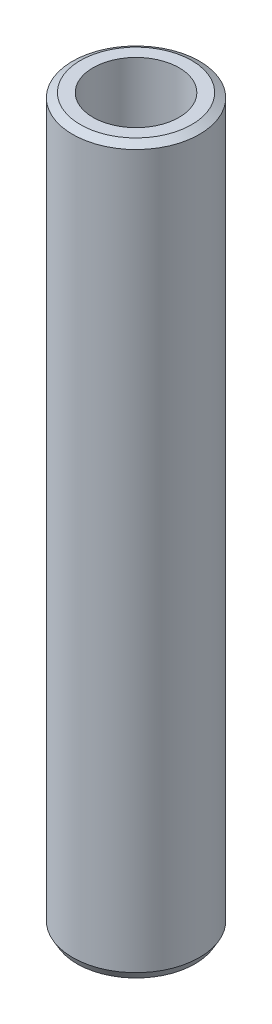
ISO-10303-21;
HEADER;
FILE_DESCRIPTION(('STEP AP214'),'2;1');
FILE_NAME('part.step','',(''),(''),'','','');
FILE_SCHEMA(('AUTOMOTIVE_DESIGN { 1 0 10303 214 1 1 1 1 }'));
ENDSEC;
DATA;
#1=APPLICATION_CONTEXT('core data for automotive mechanical design processes');
#2=APPLICATION_PROTOCOL_DEFINITION('international standard','automotive_design',2000,#1);
#3=PRODUCT_CONTEXT('',#1,'mechanical');
#4=PRODUCT('Part','Part','',(#3));
#5=PRODUCT_RELATED_PRODUCT_CATEGORY('part','',(#4));
#6=PRODUCT_DEFINITION_FORMATION('','',#4);
#7=PRODUCT_DEFINITION_CONTEXT('part definition',#1,'design');
#8=PRODUCT_DEFINITION('design','',#6,#7);
#9=PRODUCT_DEFINITION_SHAPE('','',#8);
#10=(LENGTH_UNIT() NAMED_UNIT(*) SI_UNIT(.MILLI.,.METRE.));
#11=(NAMED_UNIT(*) PLANE_ANGLE_UNIT() SI_UNIT($,.RADIAN.));
#12=(NAMED_UNIT(*) SI_UNIT($,.STERADIAN.) SOLID_ANGLE_UNIT());
#13=UNCERTAINTY_MEASURE_WITH_UNIT(LENGTH_MEASURE(1.E-05),#10,'distance_accuracy_value','');
#14=(GEOMETRIC_REPRESENTATION_CONTEXT(3) GLOBAL_UNCERTAINTY_ASSIGNED_CONTEXT((#13)) GLOBAL_UNIT_ASSIGNED_CONTEXT((#10,
#11,#12)) REPRESENTATION_CONTEXT('',''));
#15=CARTESIAN_POINT('',(0.,0.,0.));
#16=DIRECTION('',(0.,0.,1.));
#17=DIRECTION('',(1.,0.,0.));
#18=AXIS2_PLACEMENT_3D('',#15,#16,#17);
#19=CARTESIAN_POINT('',(0.,600.,0.));
#20=DIRECTION('',(0.,-1.,0.));
#21=DIRECTION('',(0.,0.,-1.));
#22=AXIS2_PLACEMENT_3D('',#19,#20,#21);
#23=CYLINDRICAL_SURFACE('',#22,52.5);
#24=CARTESIAN_POINT('',(0.,596.267829489792,0.));
#25=DIRECTION('',(0.,1.,0.));
#26=DIRECTION('',(0.,0.,1.));
#27=AXIS2_PLACEMENT_3D('',#24,#25,#26);
#28=CIRCLE('',#27,52.5);
#29=CARTESIAN_POINT('',(0.,596.267829489792,-52.5000000000001));
#30=VERTEX_POINT('',#29);
#31=EDGE_CURVE('E50',#30,#30,#28,.F.);
#32=ORIENTED_EDGE('',*,*,#31,.T.);
#33=EDGE_LOOP('',(#32));
#34=FACE_BOUND('',#33,.T.);
#35=CARTESIAN_POINT('',(0.,6.46430894618999,0.));
#36=DIRECTION('',(0.,1.,0.));
#37=DIRECTION('',(0.,0.,1.));
#38=AXIS2_PLACEMENT_3D('',#35,#36,#37);
#39=CIRCLE('',#38,52.5);
#40=CARTESIAN_POINT('',(0.,6.46430894618999,52.5));
#41=VERTEX_POINT('',#40);
#42=EDGE_CURVE('E51',#41,#41,#39,.T.);
#43=ORIENTED_EDGE('',*,*,#42,.T.);
#44=EDGE_LOOP('',(#43));
#45=FACE_BOUND('',#44,.T.);
#46=ADVANCED_FACE('F39',(#34,#45),#23,.T.);
#47=CARTESIAN_POINT('',(0.,600.,0.));
#48=DIRECTION('',(0.,1.,0.));
#49=DIRECTION('',(0.,0.,1.));
#50=AXIS2_PLACEMENT_3D('',#47,#48,#49);
#51=PLANE('',#50);
#52=CARTESIAN_POINT('',(0.,600.,0.));
#53=DIRECTION('',(0.,1.,0.));
#54=DIRECTION('',(0.,0.,1.));
#55=AXIS2_PLACEMENT_3D('',#52,#53,#54);
#56=CIRCLE('',#55,46.03569105381);
#57=CARTESIAN_POINT('',(0.,600.,-46.0356910538101));
#58=VERTEX_POINT('',#57);
#59=EDGE_CURVE('E54',#58,#58,#56,.T.);
#60=ORIENTED_EDGE('',*,*,#59,.T.);
#61=EDGE_LOOP('',(#60));
#62=FACE_BOUND('',#61,.T.);
#63=CARTESIAN_POINT('',(0.,600.,0.));
#64=DIRECTION('',(0.,1.,0.));
#65=DIRECTION('',(0.,0.,1.));
#66=AXIS2_PLACEMENT_3D('',#63,#64,#65);
#67=CIRCLE('',#66,35.6017943521871);
#68=CARTESIAN_POINT('',(0.,600.,35.6017943521871));
#69=VERTEX_POINT('',#68);
#70=EDGE_CURVE('E58',#69,#69,#67,.T.);
#71=ORIENTED_EDGE('',*,*,#70,.F.);
#72=EDGE_LOOP('',(#71));
#73=FACE_BOUND('',#72,.T.);
#74=ADVANCED_FACE('F69',(#62,#73),#51,.T.);
#75=CARTESIAN_POINT('',(0.,0.,0.));
#76=DIRECTION('',(0.,1.,0.));
#77=DIRECTION('',(0.,0.,1.));
#78=AXIS2_PLACEMENT_3D('',#75,#76,#77);
#79=PLANE('',#78);
#80=CARTESIAN_POINT('',(0.,0.,0.));
#81=DIRECTION('',(0.,1.,0.));
#82=DIRECTION('',(0.,0.,1.));
#83=AXIS2_PLACEMENT_3D('',#80,#81,#82);
#84=CIRCLE('',#83,48.7678294897922);
#85=CARTESIAN_POINT('',(0.,0.,48.7678294897922));
#86=VERTEX_POINT('',#85);
#87=EDGE_CURVE('E10',#86,#86,#84,.F.);
#88=ORIENTED_EDGE('',*,*,#87,.T.);
#89=EDGE_LOOP('',(#88));
#90=FACE_BOUND('',#89,.T.);
#91=CARTESIAN_POINT('',(0.,0.,0.));
#92=DIRECTION('',(0.,1.,0.));
#93=DIRECTION('',(0.,0.,1.));
#94=AXIS2_PLACEMENT_3D('',#91,#92,#93);
#95=CIRCLE('',#94,35.6017943521871);
#96=CARTESIAN_POINT('',(0.,0.,35.6017943521871));
#97=VERTEX_POINT('',#96);
#98=EDGE_CURVE('E63',#97,#97,#95,.T.);
#99=ORIENTED_EDGE('',*,*,#98,.T.);
#100=EDGE_LOOP('',(#99));
#101=FACE_BOUND('',#100,.T.);
#102=ADVANCED_FACE('F75',(#90,#101),#79,.F.);
#103=CARTESIAN_POINT('',(0.,600.,0.));
#104=DIRECTION('',(0.,-1.,0.));
#105=DIRECTION('',(0.,0.,-1.));
#106=AXIS2_PLACEMENT_3D('',#103,#104,#105);
#107=CYLINDRICAL_SURFACE('',#106,35.6017943521871);
#108=ORIENTED_EDGE('',*,*,#70,.T.);
#109=EDGE_LOOP('',(#108));
#110=FACE_BOUND('',#109,.T.);
#111=ORIENTED_EDGE('',*,*,#98,.F.);
#112=EDGE_LOOP('',(#111));
#113=FACE_BOUND('',#112,.T.);
#114=ADVANCED_FACE('F70',(#110,#113),#107,.F.);
#115=CARTESIAN_POINT('',(0.,600.,0.));
#116=DIRECTION('',(0.,-1.,0.));
#117=DIRECTION('',(0.,0.,-1.));
#118=AXIS2_PLACEMENT_3D('',#115,#116,#117);
#119=CONICAL_SURFACE('',#118,46.03569105381,1.04719755119659);
#120=CARTESIAN_POINT('',(0.,596.267829489792,-52.5000000000001));
#121=CARTESIAN_POINT('',(0.,596.30670626594,-52.4326634484773));
#122=CARTESIAN_POINT('',(0.,596.345583042088,-52.3653268969545));
#123=CARTESIAN_POINT('',(0.,596.423336594384,-52.2306537939088));
#124=CARTESIAN_POINT('',(0.,596.462213370532,-52.163317242386));
#125=CARTESIAN_POINT('',(0.,596.539966922828,-52.0286441393404));
#126=CARTESIAN_POINT('',(0.,596.578843698976,-51.9613075878176));
#127=CARTESIAN_POINT('',(0.,596.656597251272,-51.826634484772));
#128=CARTESIAN_POINT('',(0.,596.69547402742,-51.7592979332492));
#129=CARTESIAN_POINT('',(0.,596.773227579716,-51.6246248302035));
#130=CARTESIAN_POINT('',(0.,596.812104355864,-51.5572882786807));
#131=CARTESIAN_POINT('',(0.,596.88985790816,-51.4226151756351));
#132=CARTESIAN_POINT('',(0.,596.928734684308,-51.3552786241123));
#133=CARTESIAN_POINT('',(0.,597.006488236604,-51.2206055210667));
#134=CARTESIAN_POINT('',(0.,597.045365012752,-51.1532689695439));
#135=CARTESIAN_POINT('',(0.,597.123118565048,-51.0185958664982));
#136=CARTESIAN_POINT('',(0.,597.161995341196,-50.9512593149754));
#137=CARTESIAN_POINT('',(0.,597.239748893492,-50.8165862119298));
#138=CARTESIAN_POINT('',(0.,597.27862566964,-50.749249660407));
#139=CARTESIAN_POINT('',(0.,597.356379221936,-50.6145765573613));
#140=CARTESIAN_POINT('',(0.,597.395255998084,-50.5472400058385));
#141=CARTESIAN_POINT('',(0.,597.47300955038,-50.4125669027929));
#142=CARTESIAN_POINT('',(0.,597.511886326528,-50.3452303512701));
#143=CARTESIAN_POINT('',(0.,597.589639878824,-50.2105572482245));
#144=CARTESIAN_POINT('',(0.,597.628516654972,-50.1432206967017));
#145=CARTESIAN_POINT('',(0.,597.706270207268,-50.008547593656));
#146=CARTESIAN_POINT('',(0.,597.745146983416,-49.9412110421332));
#147=CARTESIAN_POINT('',(0.,597.822900535712,-49.8065379390876));
#148=CARTESIAN_POINT('',(0.,597.86177731186,-49.7392013875648));
#149=CARTESIAN_POINT('',(0.,597.939530864156,-49.6045282845192));
#150=CARTESIAN_POINT('',(0.,597.978407640304,-49.5371917329963));
#151=CARTESIAN_POINT('',(0.,598.0561611926,-49.4025186299507));
#152=CARTESIAN_POINT('',(0.,598.095037968748,-49.3351820784279));
#153=CARTESIAN_POINT('',(0.,598.172791521044,-49.2005089753823));
#154=CARTESIAN_POINT('',(0.,598.211668297192,-49.1331724238595));
#155=CARTESIAN_POINT('',(0.,598.289421849488,-48.9984993208138));
#156=CARTESIAN_POINT('',(0.,598.328298625636,-48.931162769291));
#157=CARTESIAN_POINT('',(0.,598.406052177932,-48.7964896662454));
#158=CARTESIAN_POINT('',(0.,598.44492895408,-48.7291531147226));
#159=CARTESIAN_POINT('',(0.,598.522682506376,-48.594480011677));
#160=CARTESIAN_POINT('',(0.,598.561559282524,-48.5271434601542));
#161=CARTESIAN_POINT('',(0.,598.63931283482,-48.3924703571085));
#162=CARTESIAN_POINT('',(0.,598.678189610968,-48.3251338055857));
#163=CARTESIAN_POINT('',(0.,598.755943163264,-48.1904607025401));
#164=CARTESIAN_POINT('',(0.,598.794819939412,-48.1231241510173));
#165=CARTESIAN_POINT('',(0.,598.872573491708,-47.9884510479717));
#166=CARTESIAN_POINT('',(0.,598.911450267856,-47.9211144964489));
#167=CARTESIAN_POINT('',(0.,598.989203820152,-47.7864413934032));
#168=CARTESIAN_POINT('',(0.,599.0280805963,-47.7191048418804));
#169=CARTESIAN_POINT('',(0.,599.105834148596,-47.5844317388348));
#170=CARTESIAN_POINT('',(0.,599.144710924744,-47.517095187312));
#171=CARTESIAN_POINT('',(0.,599.22246447704,-47.3824220842663));
#172=CARTESIAN_POINT('',(0.,599.261341253188,-47.3150855327435));
#173=CARTESIAN_POINT('',(0.,599.339094805484,-47.1804124296979));
#174=CARTESIAN_POINT('',(0.,599.377971581632,-47.1130758781751));
#175=CARTESIAN_POINT('',(0.,599.455725133928,-46.9784027751295));
#176=CARTESIAN_POINT('',(0.,599.494601910076,-46.9110662236067));
#177=CARTESIAN_POINT('',(0.,599.572355462372,-46.776393120561));
#178=CARTESIAN_POINT('',(0.,599.61123223852,-46.7090565690382));
#179=CARTESIAN_POINT('',(0.,599.688985790816,-46.5743834659926));
#180=CARTESIAN_POINT('',(0.,599.727862566964,-46.5070469144698));
#181=CARTESIAN_POINT('',(0.,599.80561611926,-46.3723738114242));
#182=CARTESIAN_POINT('',(0.,599.844492895408,-46.3050372599014));
#183=CARTESIAN_POINT('',(0.,599.922246447704,-46.1703641568557));
#184=CARTESIAN_POINT('',(0.,599.961123223852,-46.1030276053329));
#185=CARTESIAN_POINT('',(0.,600.,-46.0356910538101));
#186=B_SPLINE_CURVE_WITH_KNOTS('',3,(#120,#121,#122,#123,#124,#125,#126,#127,#128,#129,#130,
#131,#132,#133,#134,#135,#136,#137,#138,#139,#140,#141,#142,#143,#144,#145,#146,#147,#148,#149,
#150,#151,#152,#153,#154,#155,#156,#157,#158,#159,#160,#161,#162,#163,#164,#165,#166,#167,#168,
#169,#170,#171,#172,#173,#174,#175,#176,#177,#178,#179,#180,#181,#182,#183,#184,#185),
.UNSPECIFIED.,.F.,.F.,(4,2,2,2,2,2,2,2,2,2,2,2,2,2,2,2,2,2,2,2,2,2,2,2,2,2,2,2,2,2,2,2,4),(0.,
0.233260656887931,0.466521313775917,0.699781970663903,0.933042627551889,1.16630328443988,
1.39956394132786,1.63282459821585,1.86608525510383,2.09934591199182,2.33260656887981,
2.56586722576779,2.79912788265578,3.03238853954376,3.26564919643176,3.49890985331974,
3.73217051020773,3.96543116709566,4.19869182398365,4.43195248087163,4.66521313775962,
4.8984737946476,5.13173445153559,5.36499510842357,5.59825576531156,5.83151642219955,
6.06477707908753,6.29803773597552,6.5312983928635,6.76455904975149,6.99781970663947,
7.23108036352746,7.46434102041545),.UNSPECIFIED.);
#187=EDGE_CURVE('BSEAM81',#30,#58,#186,.T.);
#188=ORIENTED_EDGE('',*,*,#31,.F.);
#189=ORIENTED_EDGE('',*,*,#59,.F.);
#190=ORIENTED_EDGE('',*,*,#187,.T.);
#191=ORIENTED_EDGE('',*,*,#187,.F.);
#192=EDGE_LOOP('',(#188,#190,#189,#191));
#193=FACE_BOUND('',#192,.T.);
#194=ADVANCED_FACE('F81',(#193),#119,.T.);
#195=CARTESIAN_POINT('',(0.,6.46430894618999,0.));
#196=DIRECTION('',(0.,1.,0.));
#197=DIRECTION('',(0.,0.,1.));
#198=AXIS2_PLACEMENT_3D('',#195,#196,#197);
#199=CONICAL_SURFACE('',#198,52.5,0.523598775598305);
#200=ORIENTED_EDGE('',*,*,#87,.F.);
#201=EDGE_LOOP('',(#200));
#202=FACE_BOUND('',#201,.T.);
#203=ORIENTED_EDGE('',*,*,#42,.F.);
#204=EDGE_LOOP('',(#203));
#205=FACE_BOUND('',#204,.T.);
#206=ADVANCED_FACE('F45',(#202,#205),#199,.T.);
#207=CLOSED_SHELL('',(#46,#74,#102,#114,#194,#206));
#208=MANIFOLD_SOLID_BREP('B2',#207);
#209=ADVANCED_BREP_SHAPE_REPRESENTATION('',(#18,#208),#14);
#210=SHAPE_DEFINITION_REPRESENTATION(#9,#209);
ENDSEC;
END-ISO-10303-21;
